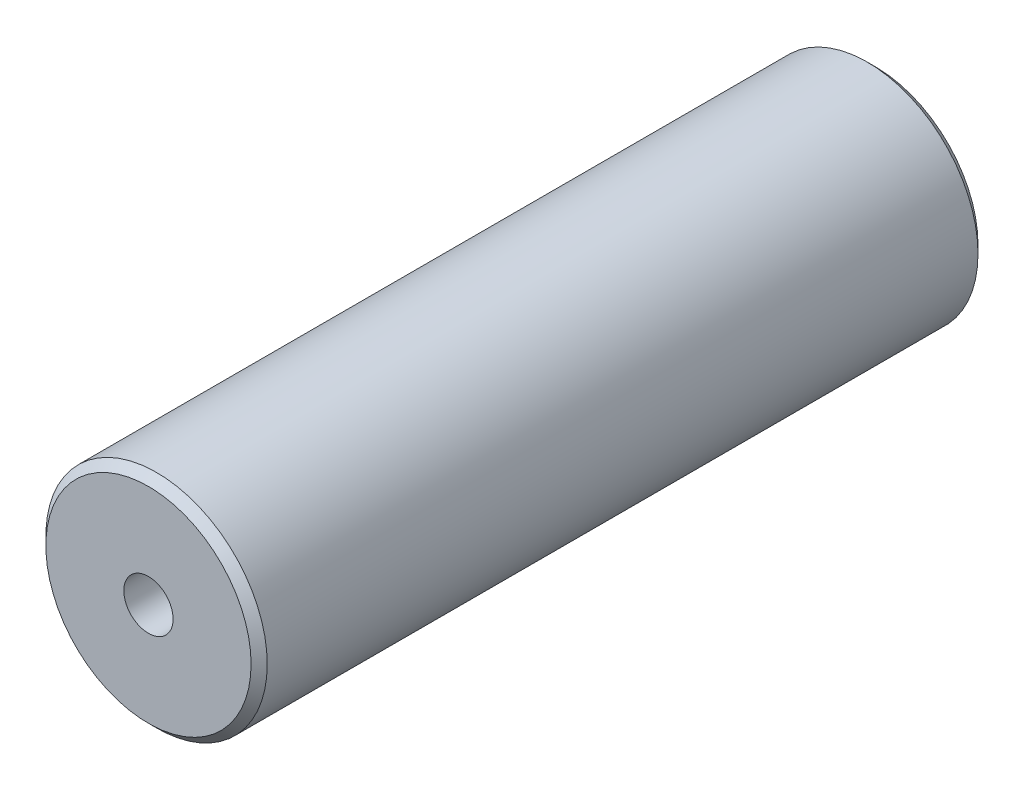
ISO-10303-21;
HEADER;
FILE_DESCRIPTION(('STEP AP214'),'2;1');
FILE_NAME('part.step','',(''),(''),'','','');
FILE_SCHEMA(('AUTOMOTIVE_DESIGN { 1 0 10303 214 1 1 1 1 }'));
ENDSEC;
DATA;
#1=APPLICATION_CONTEXT('core data for automotive mechanical design processes');
#2=APPLICATION_PROTOCOL_DEFINITION('international standard','automotive_design',2000,#1);
#3=PRODUCT_CONTEXT('',#1,'mechanical');
#4=PRODUCT('Part','Part','',(#3));
#5=PRODUCT_RELATED_PRODUCT_CATEGORY('part','',(#4));
#6=PRODUCT_DEFINITION_FORMATION('','',#4);
#7=PRODUCT_DEFINITION_CONTEXT('part definition',#1,'design');
#8=PRODUCT_DEFINITION('design','',#6,#7);
#9=PRODUCT_DEFINITION_SHAPE('','',#8);
#10=(LENGTH_UNIT() NAMED_UNIT(*) SI_UNIT(.MILLI.,.METRE.));
#11=(NAMED_UNIT(*) PLANE_ANGLE_UNIT() SI_UNIT($,.RADIAN.));
#12=(NAMED_UNIT(*) SI_UNIT($,.STERADIAN.) SOLID_ANGLE_UNIT());
#13=UNCERTAINTY_MEASURE_WITH_UNIT(LENGTH_MEASURE(1.E-05),#10,'distance_accuracy_value','');
#14=(GEOMETRIC_REPRESENTATION_CONTEXT(3) GLOBAL_UNCERTAINTY_ASSIGNED_CONTEXT((#13)) GLOBAL_UNIT_ASSIGNED_CONTEXT((#10,
#11,#12)) REPRESENTATION_CONTEXT('',''));
#15=CARTESIAN_POINT('',(0.,0.,0.));
#16=DIRECTION('',(0.,0.,1.));
#17=DIRECTION('',(1.,0.,0.));
#18=AXIS2_PLACEMENT_3D('',#15,#16,#17);
#19=CARTESIAN_POINT('',(0.,0.,90.));
#20=DIRECTION('',(0.,0.,1.));
#21=DIRECTION('',(1.,0.,0.));
#22=AXIS2_PLACEMENT_3D('',#19,#20,#21);
#23=PLANE('',#22);
#24=CARTESIAN_POINT('',(0.,0.,90.));
#25=DIRECTION('',(0.,0.,1.));
#26=DIRECTION('',(1.,0.,0.));
#27=AXIS2_PLACEMENT_3D('',#24,#25,#26);
#28=CIRCLE('',#27,12.7063866729838);
#29=CARTESIAN_POINT('',(12.7063866729838,0.,90.));
#30=VERTEX_POINT('',#29);
#31=EDGE_CURVE('E46',#30,#30,#28,.T.);
#32=ORIENTED_EDGE('',*,*,#31,.T.);
#33=EDGE_LOOP('',(#32));
#34=FACE_BOUND('',#33,.T.);
#35=CARTESIAN_POINT('',(0.,0.,90.));
#36=DIRECTION('',(0.,0.,1.));
#37=DIRECTION('',(1.,0.,0.));
#38=AXIS2_PLACEMENT_3D('',#35,#36,#37);
#39=CIRCLE('',#38,3.05);
#40=CARTESIAN_POINT('',(3.05,0.,90.));
#41=VERTEX_POINT('',#40);
#42=EDGE_CURVE('E51',#41,#41,#39,.T.);
#43=ORIENTED_EDGE('',*,*,#42,.F.);
#44=EDGE_LOOP('',(#43));
#45=FACE_BOUND('',#44,.T.);
#46=ADVANCED_FACE('F31',(#34,#45),#23,.T.);
#47=CARTESIAN_POINT('',(0.,0.,0.));
#48=DIRECTION('',(0.,0.,1.));
#49=DIRECTION('',(1.,0.,0.));
#50=AXIS2_PLACEMENT_3D('',#47,#48,#49);
#51=PLANE('',#50);
#52=CARTESIAN_POINT('',(0.,0.,0.));
#53=DIRECTION('',(0.,0.,1.));
#54=DIRECTION('',(1.,0.,0.));
#55=AXIS2_PLACEMENT_3D('',#52,#53,#54);
#56=CIRCLE('',#55,12.7063866729837);
#57=CARTESIAN_POINT('',(12.7063866729837,0.,0.));
#58=VERTEX_POINT('',#57);
#59=EDGE_CURVE('E10',#58,#58,#56,.F.);
#60=ORIENTED_EDGE('',*,*,#59,.T.);
#61=EDGE_LOOP('',(#60));
#62=FACE_BOUND('',#61,.T.);
#63=CARTESIAN_POINT('',(0.,0.,0.));
#64=DIRECTION('',(0.,0.,1.));
#65=DIRECTION('',(1.,0.,0.));
#66=AXIS2_PLACEMENT_3D('',#63,#64,#65);
#67=CIRCLE('',#66,3.05);
#68=CARTESIAN_POINT('',(3.05,0.,0.));
#69=VERTEX_POINT('',#68);
#70=EDGE_CURVE('E52',#69,#69,#67,.T.);
#71=ORIENTED_EDGE('',*,*,#70,.T.);
#72=EDGE_LOOP('',(#71));
#73=FACE_BOUND('',#72,.T.);
#74=ADVANCED_FACE('F62',(#62,#73),#51,.F.);
#75=CARTESIAN_POINT('',(0.,0.,90.));
#76=DIRECTION('',(0.,0.,-1.));
#77=DIRECTION('',(-1.,0.,0.));
#78=AXIS2_PLACEMENT_3D('',#75,#76,#77);
#79=CYLINDRICAL_SURFACE('',#78,13.7063866729838);
#80=CARTESIAN_POINT('',(0.,0.,89.0000000000001));
#81=DIRECTION('',(0.,0.,1.));
#82=DIRECTION('',(1.,0.,0.));
#83=AXIS2_PLACEMENT_3D('',#80,#81,#82);
#84=CIRCLE('',#83,13.7063866729838);
#85=CARTESIAN_POINT('',(13.7063866729838,0.,89.0000000000001));
#86=VERTEX_POINT('',#85);
#87=EDGE_CURVE('E38',#86,#86,#84,.F.);
#88=ORIENTED_EDGE('',*,*,#87,.T.);
#89=EDGE_LOOP('',(#88));
#90=FACE_BOUND('',#89,.T.);
#91=CARTESIAN_POINT('',(0.,0.,1.00000000000006));
#92=DIRECTION('',(0.,0.,1.));
#93=DIRECTION('',(1.,0.,0.));
#94=AXIS2_PLACEMENT_3D('',#91,#92,#93);
#95=CIRCLE('',#94,13.7063866729838);
#96=CARTESIAN_POINT('',(13.7063866729838,0.,1.00000000000006));
#97=VERTEX_POINT('',#96);
#98=EDGE_CURVE('E42',#97,#97,#95,.T.);
#99=ORIENTED_EDGE('',*,*,#98,.T.);
#100=EDGE_LOOP('',(#99));
#101=FACE_BOUND('',#100,.T.);
#102=ADVANCED_FACE('F68',(#90,#101),#79,.T.);
#103=CARTESIAN_POINT('',(0.,0.,90.));
#104=DIRECTION('',(0.,0.,-1.));
#105=DIRECTION('',(-1.,0.,0.));
#106=AXIS2_PLACEMENT_3D('',#103,#104,#105);
#107=CYLINDRICAL_SURFACE('',#106,3.05);
#108=ORIENTED_EDGE('',*,*,#42,.T.);
#109=EDGE_LOOP('',(#108));
#110=FACE_BOUND('',#109,.T.);
#111=ORIENTED_EDGE('',*,*,#70,.F.);
#112=EDGE_LOOP('',(#111));
#113=FACE_BOUND('',#112,.T.);
#114=ADVANCED_FACE('F58',(#110,#113),#107,.F.);
#115=CARTESIAN_POINT('',(0.,0.,90.));
#116=DIRECTION('',(0.,0.,-1.));
#117=DIRECTION('',(-1.,0.,0.));
#118=AXIS2_PLACEMENT_3D('',#115,#116,#117);
#119=CONICAL_SURFACE('',#118,12.7063866729838,0.785398163397449);
#120=ORIENTED_EDGE('',*,*,#87,.F.);
#121=EDGE_LOOP('',(#120));
#122=FACE_BOUND('',#121,.T.);
#123=ORIENTED_EDGE('',*,*,#31,.F.);
#124=EDGE_LOOP('',(#123));
#125=FACE_BOUND('',#124,.T.);
#126=ADVANCED_FACE('F73',(#122,#125),#119,.T.);
#127=CARTESIAN_POINT('',(0.,0.,1.00000000000006));
#128=DIRECTION('',(0.,0.,1.));
#129=DIRECTION('',(1.,0.,0.));
#130=AXIS2_PLACEMENT_3D('',#127,#128,#129);
#131=CONICAL_SURFACE('',#130,13.7063866729838,0.785398163397452);
#132=ORIENTED_EDGE('',*,*,#59,.F.);
#133=EDGE_LOOP('',(#132));
#134=FACE_BOUND('',#133,.T.);
#135=ORIENTED_EDGE('',*,*,#98,.F.);
#136=EDGE_LOOP('',(#135));
#137=FACE_BOUND('',#136,.T.);
#138=ADVANCED_FACE('F33',(#134,#137),#131,.T.);
#139=CLOSED_SHELL('',(#46,#74,#102,#114,#126,#138));
#140=MANIFOLD_SOLID_BREP('B2',#139);
#141=ADVANCED_BREP_SHAPE_REPRESENTATION('',(#18,#140),#14);
#142=SHAPE_DEFINITION_REPRESENTATION(#9,#141);
ENDSEC;
END-ISO-10303-21;
